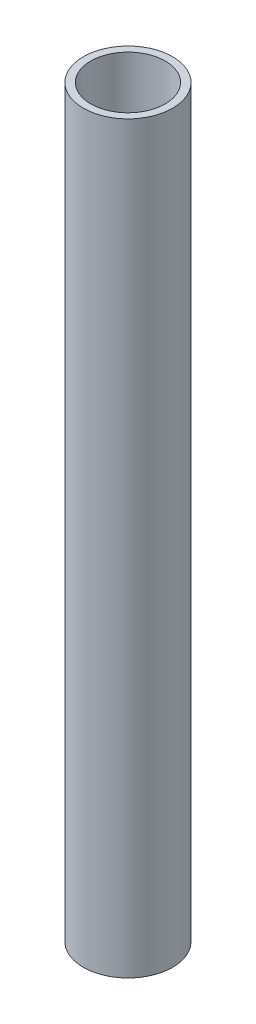
ISO-10303-21;
HEADER;
FILE_DESCRIPTION(('STEP AP214'),'2;1');
FILE_NAME('part.step','',(''),(''),'','','');
FILE_SCHEMA(('AUTOMOTIVE_DESIGN { 1 0 10303 214 1 1 1 1 }'));
ENDSEC;
DATA;
#1=APPLICATION_CONTEXT('core data for automotive mechanical design processes');
#2=APPLICATION_PROTOCOL_DEFINITION('international standard','automotive_design',2000,#1);
#3=PRODUCT_CONTEXT('',#1,'mechanical');
#4=PRODUCT('Part','Part','',(#3));
#5=PRODUCT_RELATED_PRODUCT_CATEGORY('part','',(#4));
#6=PRODUCT_DEFINITION_FORMATION('','',#4);
#7=PRODUCT_DEFINITION_CONTEXT('part definition',#1,'design');
#8=PRODUCT_DEFINITION('design','',#6,#7);
#9=PRODUCT_DEFINITION_SHAPE('','',#8);
#10=(LENGTH_UNIT() NAMED_UNIT(*) SI_UNIT(.MILLI.,.METRE.));
#11=(NAMED_UNIT(*) PLANE_ANGLE_UNIT() SI_UNIT($,.RADIAN.));
#12=(NAMED_UNIT(*) SI_UNIT($,.STERADIAN.) SOLID_ANGLE_UNIT());
#13=UNCERTAINTY_MEASURE_WITH_UNIT(LENGTH_MEASURE(1.E-05),#10,'distance_accuracy_value','');
#14=(GEOMETRIC_REPRESENTATION_CONTEXT(3) GLOBAL_UNCERTAINTY_ASSIGNED_CONTEXT((#13)) GLOBAL_UNIT_ASSIGNED_CONTEXT((#10,
#11,#12)) REPRESENTATION_CONTEXT('',''));
#15=CARTESIAN_POINT('',(0.,0.,0.));
#16=DIRECTION('',(0.,0.,1.));
#17=DIRECTION('',(1.,0.,0.));
#18=AXIS2_PLACEMENT_3D('',#15,#16,#17);
#19=CARTESIAN_POINT('',(0.,50.,0.));
#20=DIRECTION('',(0.,1.,0.));
#21=DIRECTION('',(0.,0.,1.));
#22=AXIS2_PLACEMENT_3D('',#19,#20,#21);
#23=PLANE('',#22);
#24=CARTESIAN_POINT('',(0.,50.,0.));
#25=DIRECTION('',(0.,1.,0.));
#26=DIRECTION('',(0.,0.,1.));
#27=AXIS2_PLACEMENT_3D('',#24,#25,#26);
#28=CIRCLE('',#27,3.);
#29=CARTESIAN_POINT('',(0.,50.,3.));
#30=VERTEX_POINT('',#29);
#31=EDGE_CURVE('E10',#30,#30,#28,.T.);
#32=ORIENTED_EDGE('',*,*,#31,.T.);
#33=EDGE_LOOP('',(#32));
#34=FACE_BOUND('',#33,.T.);
#35=CARTESIAN_POINT('',(0.,50.,0.));
#36=DIRECTION('',(0.,1.,0.));
#37=DIRECTION('',(0.,0.,1.));
#38=AXIS2_PLACEMENT_3D('',#35,#36,#37);
#39=CIRCLE('',#38,2.5);
#40=CARTESIAN_POINT('',(0.,50.,2.5));
#41=VERTEX_POINT('',#40);
#42=EDGE_CURVE('E56',#41,#41,#39,.T.);
#43=ORIENTED_EDGE('',*,*,#42,.F.);
#44=EDGE_LOOP('',(#43));
#45=FACE_BOUND('',#44,.T.);
#46=ADVANCED_FACE('F43',(#34,#45),#23,.T.);
#47=CARTESIAN_POINT('',(0.,0.,0.));
#48=DIRECTION('',(0.,1.,0.));
#49=DIRECTION('',(0.,0.,1.));
#50=AXIS2_PLACEMENT_3D('',#47,#48,#49);
#51=PLANE('',#50);
#52=CARTESIAN_POINT('',(0.,0.,0.));
#53=DIRECTION('',(0.,1.,0.));
#54=DIRECTION('',(0.,0.,1.));
#55=AXIS2_PLACEMENT_3D('',#52,#53,#54);
#56=CIRCLE('',#55,3.);
#57=CARTESIAN_POINT('',(0.,0.,3.));
#58=VERTEX_POINT('',#57);
#59=EDGE_CURVE('E47',#58,#58,#56,.T.);
#60=ORIENTED_EDGE('',*,*,#59,.F.);
#61=EDGE_LOOP('',(#60));
#62=FACE_BOUND('',#61,.T.);
#63=CARTESIAN_POINT('',(0.,0.,0.));
#64=DIRECTION('',(0.,1.,0.));
#65=DIRECTION('',(0.,0.,1.));
#66=AXIS2_PLACEMENT_3D('',#63,#64,#65);
#67=CIRCLE('',#66,2.5);
#68=CARTESIAN_POINT('',(0.,0.,2.5));
#69=VERTEX_POINT('',#68);
#70=EDGE_CURVE('E58',#69,#69,#67,.T.);
#71=ORIENTED_EDGE('',*,*,#70,.T.);
#72=EDGE_LOOP('',(#71));
#73=FACE_BOUND('',#72,.T.);
#74=ADVANCED_FACE('F70',(#62,#73),#51,.F.);
#75=CARTESIAN_POINT('',(0.,50.,0.));
#76=DIRECTION('',(0.,-1.,0.));
#77=DIRECTION('',(0.,0.,-1.));
#78=AXIS2_PLACEMENT_3D('',#75,#76,#77);
#79=CYLINDRICAL_SURFACE('',#78,3.);
#80=ORIENTED_EDGE('',*,*,#31,.F.);
#81=EDGE_LOOP('',(#80));
#82=FACE_BOUND('',#81,.T.);
#83=ORIENTED_EDGE('',*,*,#59,.T.);
#84=EDGE_LOOP('',(#83));
#85=FACE_BOUND('',#84,.T.);
#86=ADVANCED_FACE('F45',(#82,#85),#79,.T.);
#87=CARTESIAN_POINT('',(0.,50.,0.));
#88=DIRECTION('',(0.,-1.,0.));
#89=DIRECTION('',(0.,0.,-1.));
#90=AXIS2_PLACEMENT_3D('',#87,#88,#89);
#91=CYLINDRICAL_SURFACE('',#90,2.5);
#92=ORIENTED_EDGE('',*,*,#42,.T.);
#93=EDGE_LOOP('',(#92));
#94=FACE_BOUND('',#93,.T.);
#95=ORIENTED_EDGE('',*,*,#70,.F.);
#96=EDGE_LOOP('',(#95));
#97=FACE_BOUND('',#96,.T.);
#98=ADVANCED_FACE('F66',(#94,#97),#91,.F.);
#99=CLOSED_SHELL('',(#46,#74,#86,#98));
#100=MANIFOLD_SOLID_BREP('B2',#99);
#101=ADVANCED_BREP_SHAPE_REPRESENTATION('',(#18,#100),#14);
#102=SHAPE_DEFINITION_REPRESENTATION(#9,#101);
ENDSEC;
END-ISO-10303-21;
